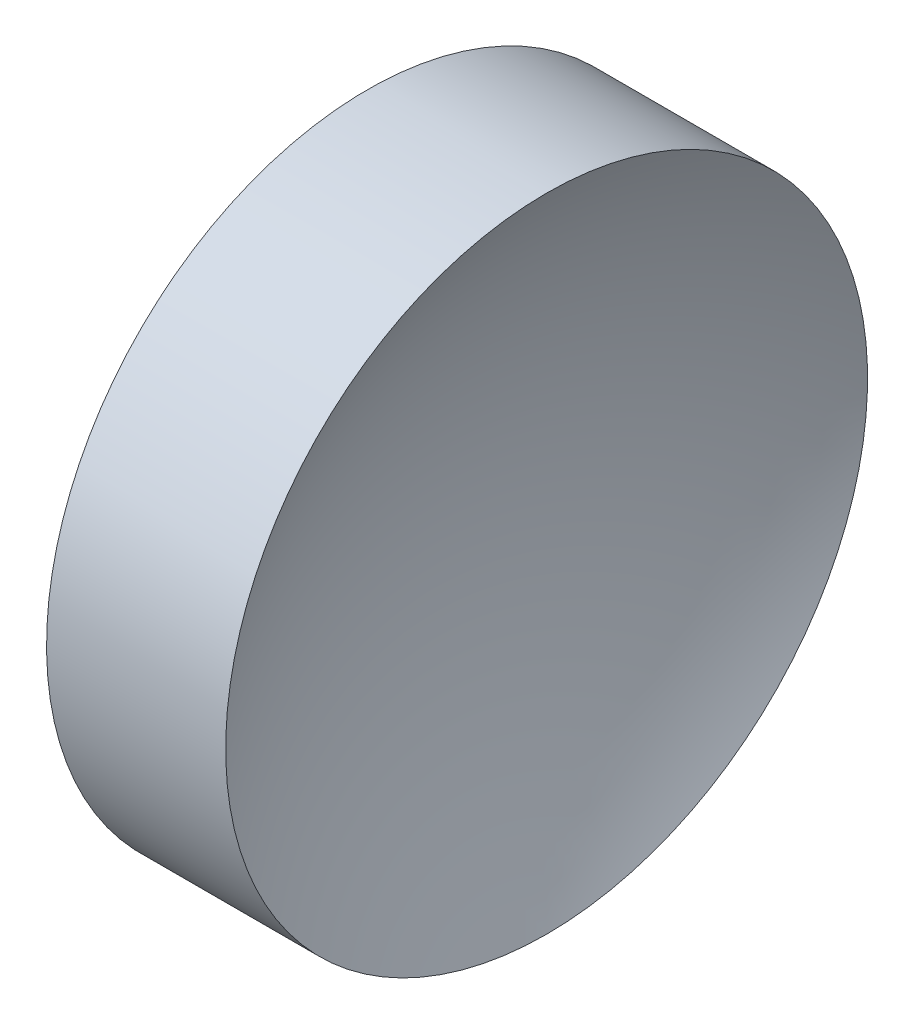
ISO-10303-21;
HEADER;
FILE_DESCRIPTION(('STEP AP214'),'2;1');
FILE_NAME('part.step','',(''),(''),'','','');
FILE_SCHEMA(('AUTOMOTIVE_DESIGN { 1 0 10303 214 1 1 1 1 }'));
ENDSEC;
DATA;
#1=APPLICATION_CONTEXT('core data for automotive mechanical design processes');
#2=APPLICATION_PROTOCOL_DEFINITION('international standard','automotive_design',2000,#1);
#3=PRODUCT_CONTEXT('',#1,'mechanical');
#4=PRODUCT('Part','Part','',(#3));
#5=PRODUCT_RELATED_PRODUCT_CATEGORY('part','',(#4));
#6=PRODUCT_DEFINITION_FORMATION('','',#4);
#7=PRODUCT_DEFINITION_CONTEXT('part definition',#1,'design');
#8=PRODUCT_DEFINITION('design','',#6,#7);
#9=PRODUCT_DEFINITION_SHAPE('','',#8);
#10=(LENGTH_UNIT() NAMED_UNIT(*) SI_UNIT(.MILLI.,.METRE.));
#11=(NAMED_UNIT(*) PLANE_ANGLE_UNIT() SI_UNIT($,.RADIAN.));
#12=(NAMED_UNIT(*) SI_UNIT($,.STERADIAN.) SOLID_ANGLE_UNIT());
#13=UNCERTAINTY_MEASURE_WITH_UNIT(LENGTH_MEASURE(1.E-05),#10,'distance_accuracy_value','');
#14=(GEOMETRIC_REPRESENTATION_CONTEXT(3) GLOBAL_UNCERTAINTY_ASSIGNED_CONTEXT((#13)) GLOBAL_UNIT_ASSIGNED_CONTEXT((#10,
#11,#12)) REPRESENTATION_CONTEXT('',''));
#15=CARTESIAN_POINT('',(0.,0.,0.));
#16=DIRECTION('',(0.,0.,1.));
#17=DIRECTION('',(1.,0.,0.));
#18=AXIS2_PLACEMENT_3D('',#15,#16,#17);
#19=CARTESIAN_POINT('',(34.2542320536207,13.031126091403,0.));
#20=DIRECTION('',(-1.,0.,0.));
#21=DIRECTION('',(0.,1.,0.));
#22=AXIS2_PLACEMENT_3D('',#19,#20,#21);
#23=SPHERICAL_SURFACE('',#22,10.33);
#24=CARTESIAN_POINT('',(25.2149345145416,13.031126091403,0.));
#25=DIRECTION('',(-1.,0.,0.));
#26=DIRECTION('',(0.,-1.,0.));
#27=AXIS2_PLACEMENT_3D('',#24,#25,#26);
#28=CIRCLE('',#27,5.);
#29=CARTESIAN_POINT('',(25.2149345145416,8.03112609140304,0.));
#30=VERTEX_POINT('',#29);
#31=EDGE_CURVE('E10',#30,#30,#28,.T.);
#32=ORIENTED_EDGE('',*,*,#31,.F.);
#33=EDGE_LOOP('',(#32));
#34=FACE_BOUND('',#33,.T.);
#35=ADVANCED_FACE('F35',(#34),#23,.F.);
#36=CARTESIAN_POINT('',(21.5059751180825,13.031126091403,0.));
#37=DIRECTION('',(-1.,0.,0.));
#38=DIRECTION('',(0.,-1.,0.));
#39=AXIS2_PLACEMENT_3D('',#36,#37,#38);
#40=CYLINDRICAL_SURFACE('',#39,5.);
#41=CARTESIAN_POINT('',(22.4242320536207,13.031126091403,0.));
#42=DIRECTION('',(-1.,0.,0.));
#43=DIRECTION('',(0.,-1.,0.));
#44=AXIS2_PLACEMENT_3D('',#41,#42,#43);
#45=CIRCLE('',#44,5.);
#46=CARTESIAN_POINT('',(22.4242320536207,8.03112609140304,0.));
#47=VERTEX_POINT('',#46);
#48=EDGE_CURVE('E41',#47,#47,#45,.T.);
#49=ORIENTED_EDGE('',*,*,#48,.F.);
#50=EDGE_LOOP('',(#49));
#51=FACE_BOUND('',#50,.T.);
#52=ORIENTED_EDGE('',*,*,#31,.T.);
#53=EDGE_LOOP('',(#52));
#54=FACE_BOUND('',#53,.T.);
#55=ADVANCED_FACE('F49',(#51,#54),#40,.T.);
#56=CARTESIAN_POINT('',(22.4242320536207,13.031126091403,0.));
#57=DIRECTION('',(1.,0.,0.));
#58=DIRECTION('',(0.,1.,0.));
#59=AXIS2_PLACEMENT_3D('',#56,#57,#58);
#60=PLANE('',#59);
#61=ORIENTED_EDGE('',*,*,#48,.T.);
#62=EDGE_LOOP('',(#61));
#63=FACE_BOUND('',#62,.T.);
#64=ADVANCED_FACE('F47',(#63),#60,.F.);
#65=CLOSED_SHELL('',(#35,#55,#64));
#66=MANIFOLD_SOLID_BREP('B2',#65);
#67=ADVANCED_BREP_SHAPE_REPRESENTATION('',(#18,#66),#14);
#68=SHAPE_DEFINITION_REPRESENTATION(#9,#67);
ENDSEC;
END-ISO-10303-21;
